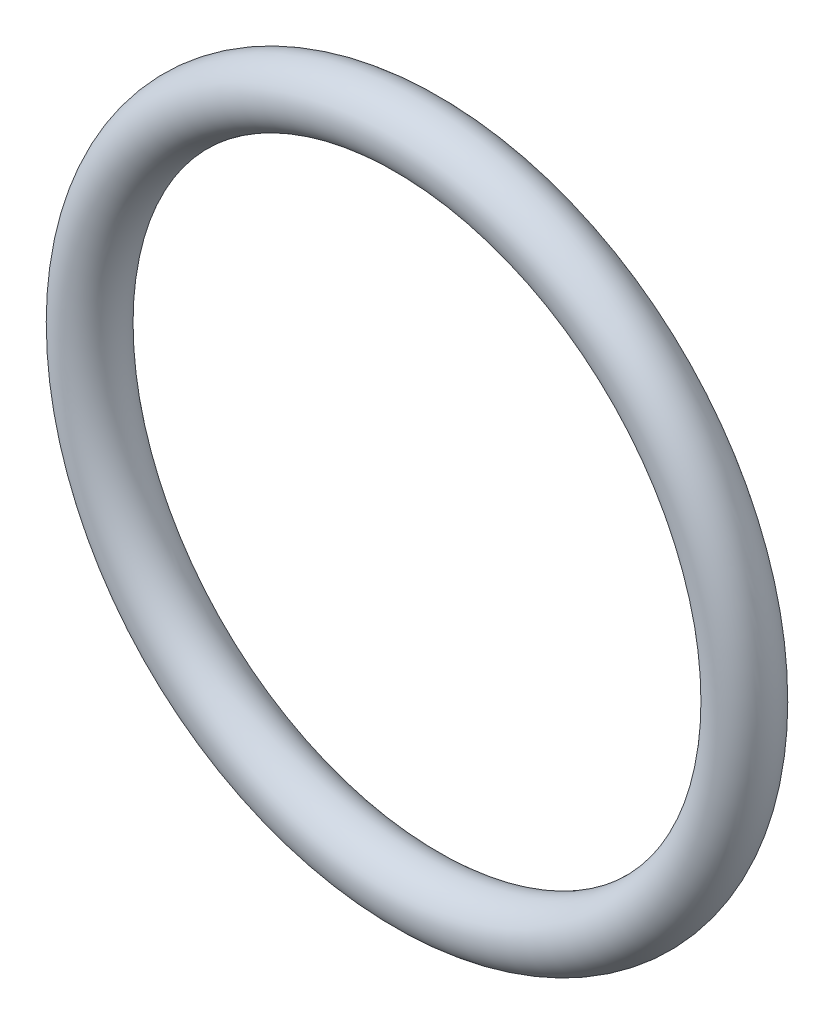
ISO-10303-21;
HEADER;
FILE_DESCRIPTION(('STEP AP214'),'2;1');
FILE_NAME('part.step','',(''),(''),'','','');
FILE_SCHEMA(('AUTOMOTIVE_DESIGN { 1 0 10303 214 1 1 1 1 }'));
ENDSEC;
DATA;
#1=APPLICATION_CONTEXT('core data for automotive mechanical design processes');
#2=APPLICATION_PROTOCOL_DEFINITION('international standard','automotive_design',2000,#1);
#3=PRODUCT_CONTEXT('',#1,'mechanical');
#4=PRODUCT('Part','Part','',(#3));
#5=PRODUCT_RELATED_PRODUCT_CATEGORY('part','',(#4));
#6=PRODUCT_DEFINITION_FORMATION('','',#4);
#7=PRODUCT_DEFINITION_CONTEXT('part definition',#1,'design');
#8=PRODUCT_DEFINITION('design','',#6,#7);
#9=PRODUCT_DEFINITION_SHAPE('','',#8);
#10=(LENGTH_UNIT() NAMED_UNIT(*) SI_UNIT(.MILLI.,.METRE.));
#11=(NAMED_UNIT(*) PLANE_ANGLE_UNIT() SI_UNIT($,.RADIAN.));
#12=(NAMED_UNIT(*) SI_UNIT($,.STERADIAN.) SOLID_ANGLE_UNIT());
#13=UNCERTAINTY_MEASURE_WITH_UNIT(LENGTH_MEASURE(1.E-05),#10,'distance_accuracy_value','');
#14=(GEOMETRIC_REPRESENTATION_CONTEXT(3) GLOBAL_UNCERTAINTY_ASSIGNED_CONTEXT((#13)) GLOBAL_UNIT_ASSIGNED_CONTEXT((#10,
#11,#12)) REPRESENTATION_CONTEXT('',''));
#15=CARTESIAN_POINT('',(0.,0.,0.));
#16=DIRECTION('',(0.,0.,1.));
#17=DIRECTION('',(1.,0.,0.));
#18=AXIS2_PLACEMENT_3D('',#15,#16,#17);
#19=CARTESIAN_POINT('',(0.,0.,0.));
#20=DIRECTION('',(0.,0.,1.));
#21=DIRECTION('',(1.,0.,0.));
#22=AXIS2_PLACEMENT_3D('',#19,#20,#21);
#23=TOROIDAL_SURFACE('',#22,9.4742,0.888999999999998);
#24=CARTESIAN_POINT('',(10.3632,0.,0.));
#25=VERTEX_POINT('',#24);
#26=VERTEX_LOOP('',#25);
#27=FACE_BOUND('',#26,.T.);
#28=ADVANCED_FACE('F30',(#27),#23,.T.);
#29=CLOSED_SHELL('',(#28));
#30=MANIFOLD_SOLID_BREP('B2',#29);
#31=ADVANCED_BREP_SHAPE_REPRESENTATION('',(#18,#30),#14);
#32=SHAPE_DEFINITION_REPRESENTATION(#9,#31);
ENDSEC;
END-ISO-10303-21;
